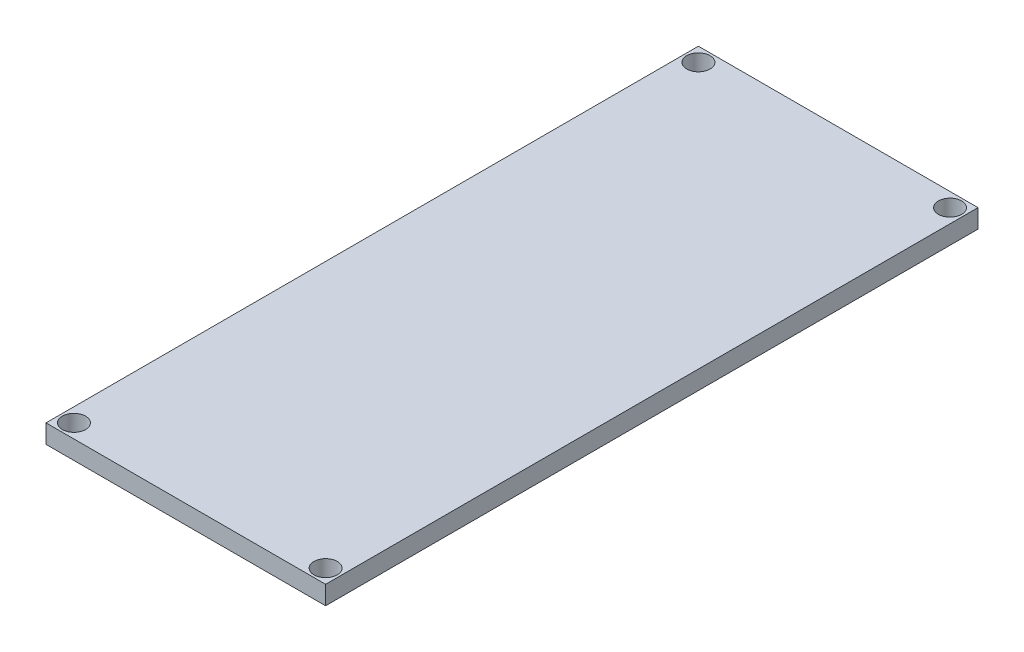
ISO-10303-21;
HEADER;
FILE_DESCRIPTION(('STEP AP214'),'2;1');
FILE_NAME('part.step','',(''),(''),'','','');
FILE_SCHEMA(('AUTOMOTIVE_DESIGN { 1 0 10303 214 1 1 1 1 }'));
ENDSEC;
DATA;
#1=APPLICATION_CONTEXT('core data for automotive mechanical design processes');
#2=APPLICATION_PROTOCOL_DEFINITION('international standard','automotive_design',2000,#1);
#3=PRODUCT_CONTEXT('',#1,'mechanical');
#4=PRODUCT('Part','Part','',(#3));
#5=PRODUCT_RELATED_PRODUCT_CATEGORY('part','',(#4));
#6=PRODUCT_DEFINITION_FORMATION('','',#4);
#7=PRODUCT_DEFINITION_CONTEXT('part definition',#1,'design');
#8=PRODUCT_DEFINITION('design','',#6,#7);
#9=PRODUCT_DEFINITION_SHAPE('','',#8);
#10=(LENGTH_UNIT() NAMED_UNIT(*) SI_UNIT(.MILLI.,.METRE.));
#11=(NAMED_UNIT(*) PLANE_ANGLE_UNIT() SI_UNIT($,.RADIAN.));
#12=(NAMED_UNIT(*) SI_UNIT($,.STERADIAN.) SOLID_ANGLE_UNIT());
#13=UNCERTAINTY_MEASURE_WITH_UNIT(LENGTH_MEASURE(1.E-05),#10,'distance_accuracy_value','');
#14=(GEOMETRIC_REPRESENTATION_CONTEXT(3) GLOBAL_UNCERTAINTY_ASSIGNED_CONTEXT((#13)) GLOBAL_UNIT_ASSIGNED_CONTEXT((#10,
#11,#12)) REPRESENTATION_CONTEXT('',''));
#15=CARTESIAN_POINT('',(0.,0.,0.));
#16=DIRECTION('',(0.,0.,1.));
#17=DIRECTION('',(1.,0.,0.));
#18=AXIS2_PLACEMENT_3D('',#15,#16,#17);
#19=CARTESIAN_POINT('',(-15.,2.,35.));
#20=DIRECTION('',(1.,0.,0.));
#21=DIRECTION('',(0.,0.,-1.));
#22=AXIS2_PLACEMENT_3D('',#19,#20,#21);
#23=PLANE('',#22);
#24=DIRECTION('',(0.,0.,1.));
#25=VECTOR('',#24,1.);
#26=CARTESIAN_POINT('',(-15.,0.,35.));
#27=LINE('',#26,#25);
#28=CARTESIAN_POINT('',(-15.,0.,-35.));
#29=VERTEX_POINT('',#28);
#30=CARTESIAN_POINT('',(-15.,0.,35.));
#31=VERTEX_POINT('',#30);
#32=EDGE_CURVE('E107',#29,#31,#27,.T.);
#33=ORIENTED_EDGE('',*,*,#32,.T.);
#34=DIRECTION('',(0.,-1.,0.));
#35=VECTOR('',#34,1.);
#36=CARTESIAN_POINT('',(-15.,2.,35.));
#37=LINE('',#36,#35);
#38=CARTESIAN_POINT('',(-15.,2.,35.));
#39=VERTEX_POINT('',#38);
#40=EDGE_CURVE('E11',#39,#31,#37,.T.);
#41=ORIENTED_EDGE('',*,*,#40,.F.);
#42=DIRECTION('',(0.,0.,1.));
#43=VECTOR('',#42,1.);
#44=CARTESIAN_POINT('',(-15.,2.,35.));
#45=LINE('',#44,#43);
#46=CARTESIAN_POINT('',(-15.,2.,-35.));
#47=VERTEX_POINT('',#46);
#48=EDGE_CURVE('E91',#47,#39,#45,.T.);
#49=ORIENTED_EDGE('',*,*,#48,.F.);
#50=DIRECTION('',(0.,-1.,0.));
#51=VECTOR('',#50,1.);
#52=CARTESIAN_POINT('',(-15.,2.,-35.));
#53=LINE('',#52,#51);
#54=EDGE_CURVE('E103',#47,#29,#53,.T.);
#55=ORIENTED_EDGE('',*,*,#54,.T.);
#56=EDGE_LOOP('',(#33,#41,#49,#55));
#57=FACE_BOUND('',#56,.T.);
#58=ADVANCED_FACE('F39',(#57),#23,.F.);
#59=CARTESIAN_POINT('',(15.,2.,35.));
#60=DIRECTION('',(0.,0.,-1.));
#61=DIRECTION('',(-1.,0.,0.));
#62=AXIS2_PLACEMENT_3D('',#59,#60,#61);
#63=PLANE('',#62);
#64=DIRECTION('',(1.,0.,0.));
#65=VECTOR('',#64,1.);
#66=CARTESIAN_POINT('',(15.,0.,35.));
#67=LINE('',#66,#65);
#68=CARTESIAN_POINT('',(15.,0.,35.));
#69=VERTEX_POINT('',#68);
#70=EDGE_CURVE('E96',#31,#69,#67,.T.);
#71=ORIENTED_EDGE('',*,*,#70,.T.);
#72=DIRECTION('',(0.,-1.,0.));
#73=VECTOR('',#72,1.);
#74=CARTESIAN_POINT('',(15.,2.,35.));
#75=LINE('',#74,#73);
#76=CARTESIAN_POINT('',(15.,2.,35.));
#77=VERTEX_POINT('',#76);
#78=EDGE_CURVE('E48',#77,#69,#75,.T.);
#79=ORIENTED_EDGE('',*,*,#78,.F.);
#80=DIRECTION('',(1.,0.,0.));
#81=VECTOR('',#80,1.);
#82=CARTESIAN_POINT('',(15.,2.,35.));
#83=LINE('',#82,#81);
#84=EDGE_CURVE('E86',#39,#77,#83,.T.);
#85=ORIENTED_EDGE('',*,*,#84,.F.);
#86=ORIENTED_EDGE('',*,*,#40,.T.);
#87=EDGE_LOOP('',(#71,#79,#85,#86));
#88=FACE_BOUND('',#87,.T.);
#89=ADVANCED_FACE('F95',(#88),#63,.F.);
#90=CARTESIAN_POINT('',(15.,2.,35.));
#91=DIRECTION('',(-1.,0.,0.));
#92=DIRECTION('',(0.,0.,1.));
#93=AXIS2_PLACEMENT_3D('',#90,#91,#92);
#94=PLANE('',#93);
#95=DIRECTION('',(0.,0.,-1.));
#96=VECTOR('',#95,1.);
#97=CARTESIAN_POINT('',(15.,0.,35.));
#98=LINE('',#97,#96);
#99=CARTESIAN_POINT('',(15.,0.,-35.));
#100=VERTEX_POINT('',#99);
#101=EDGE_CURVE('E73',#69,#100,#98,.T.);
#102=ORIENTED_EDGE('',*,*,#101,.T.);
#103=DIRECTION('',(0.,-1.,0.));
#104=VECTOR('',#103,1.);
#105=CARTESIAN_POINT('',(15.,2.,-35.));
#106=LINE('',#105,#104);
#107=CARTESIAN_POINT('',(15.,2.,-35.));
#108=VERTEX_POINT('',#107);
#109=EDGE_CURVE('E98',#108,#100,#106,.T.);
#110=ORIENTED_EDGE('',*,*,#109,.F.);
#111=DIRECTION('',(0.,0.,-1.));
#112=VECTOR('',#111,1.);
#113=CARTESIAN_POINT('',(15.,2.,35.));
#114=LINE('',#113,#112);
#115=EDGE_CURVE('E89',#77,#108,#114,.T.);
#116=ORIENTED_EDGE('',*,*,#115,.F.);
#117=ORIENTED_EDGE('',*,*,#78,.T.);
#118=EDGE_LOOP('',(#102,#110,#116,#117));
#119=FACE_BOUND('',#118,.T.);
#120=ADVANCED_FACE('F99',(#119),#94,.F.);
#121=CARTESIAN_POINT('',(15.,2.,-35.));
#122=DIRECTION('',(0.,0.,1.));
#123=DIRECTION('',(1.,0.,0.));
#124=AXIS2_PLACEMENT_3D('',#121,#122,#123);
#125=PLANE('',#124);
#126=DIRECTION('',(-1.,0.,0.));
#127=VECTOR('',#126,1.);
#128=CARTESIAN_POINT('',(15.,0.,-35.));
#129=LINE('',#128,#127);
#130=EDGE_CURVE('E79',#100,#29,#129,.T.);
#131=ORIENTED_EDGE('',*,*,#130,.T.);
#132=ORIENTED_EDGE('',*,*,#54,.F.);
#133=DIRECTION('',(-1.,0.,0.));
#134=VECTOR('',#133,1.);
#135=CARTESIAN_POINT('',(15.,2.,-35.));
#136=LINE('',#135,#134);
#137=EDGE_CURVE('E56',#108,#47,#136,.T.);
#138=ORIENTED_EDGE('',*,*,#137,.F.);
#139=ORIENTED_EDGE('',*,*,#109,.T.);
#140=EDGE_LOOP('',(#131,#132,#138,#139));
#141=FACE_BOUND('',#140,.T.);
#142=ADVANCED_FACE('F121',(#141),#125,.F.);
#143=CARTESIAN_POINT('',(0.,2.,0.));
#144=DIRECTION('',(0.,1.,0.));
#145=DIRECTION('',(0.,0.,1.));
#146=AXIS2_PLACEMENT_3D('',#143,#144,#145);
#147=PLANE('',#146);
#148=CARTESIAN_POINT('',(-13.5,2.,33.5));
#149=DIRECTION('',(0.,1.,0.));
#150=DIRECTION('',(0.,0.,-1.));
#151=AXIS2_PLACEMENT_3D('',#148,#149,#150);
#152=CIRCLE('',#151,1.25);
#153=CARTESIAN_POINT('',(-13.5,2.,32.25));
#154=VERTEX_POINT('',#153);
#155=EDGE_CURVE('E141',#154,#154,#152,.T.);
#156=ORIENTED_EDGE('',*,*,#155,.F.);
#157=EDGE_LOOP('',(#156));
#158=FACE_BOUND('',#157,.T.);
#159=CARTESIAN_POINT('',(13.4999999999998,2.,33.5000000000001));
#160=DIRECTION('',(0.,1.,0.));
#161=DIRECTION('',(0.,0.,1.));
#162=AXIS2_PLACEMENT_3D('',#159,#160,#161);
#163=CIRCLE('',#162,1.25);
#164=CARTESIAN_POINT('',(13.4999999999998,2.,34.7500000000001));
#165=VERTEX_POINT('',#164);
#166=EDGE_CURVE('E140',#165,#165,#163,.T.);
#167=ORIENTED_EDGE('',*,*,#166,.F.);
#168=EDGE_LOOP('',(#167));
#169=FACE_BOUND('',#168,.T.);
#170=CARTESIAN_POINT('',(13.4999999999998,2.,-33.5000000000001));
#171=DIRECTION('',(0.,1.,0.));
#172=DIRECTION('',(0.,0.,-1.));
#173=AXIS2_PLACEMENT_3D('',#170,#171,#172);
#174=CIRCLE('',#173,1.25);
#175=CARTESIAN_POINT('',(13.4999999999998,2.,-34.7500000000001));
#176=VERTEX_POINT('',#175);
#177=EDGE_CURVE('E149',#176,#176,#174,.T.);
#178=ORIENTED_EDGE('',*,*,#177,.F.);
#179=EDGE_LOOP('',(#178));
#180=FACE_BOUND('',#179,.T.);
#181=CARTESIAN_POINT('',(-13.5,2.,-33.5));
#182=DIRECTION('',(0.,1.,0.));
#183=DIRECTION('',(0.,0.,1.));
#184=AXIS2_PLACEMENT_3D('',#181,#182,#183);
#185=CIRCLE('',#184,1.25);
#186=CARTESIAN_POINT('',(-13.5,2.,-32.25));
#187=VERTEX_POINT('',#186);
#188=EDGE_CURVE('E131',#187,#187,#185,.T.);
#189=ORIENTED_EDGE('',*,*,#188,.F.);
#190=EDGE_LOOP('',(#189));
#191=FACE_BOUND('',#190,.T.);
#192=ORIENTED_EDGE('',*,*,#48,.T.);
#193=ORIENTED_EDGE('',*,*,#84,.T.);
#194=ORIENTED_EDGE('',*,*,#115,.T.);
#195=ORIENTED_EDGE('',*,*,#137,.T.);
#196=EDGE_LOOP('',(#192,#193,#194,#195));
#197=FACE_BOUND('',#196,.T.);
#198=ADVANCED_FACE('F87',(#158,#169,#180,#191,#197),#147,.T.);
#199=CARTESIAN_POINT('',(0.,0.,0.));
#200=DIRECTION('',(0.,1.,0.));
#201=DIRECTION('',(0.,0.,1.));
#202=AXIS2_PLACEMENT_3D('',#199,#200,#201);
#203=PLANE('',#202);
#204=CARTESIAN_POINT('',(-13.5,0.,33.5));
#205=DIRECTION('',(0.,1.,0.));
#206=DIRECTION('',(0.,0.,1.));
#207=AXIS2_PLACEMENT_3D('',#204,#205,#206);
#208=CIRCLE('',#207,1.25);
#209=CARTESIAN_POINT('',(-13.5,0.,34.75));
#210=VERTEX_POINT('',#209);
#211=EDGE_CURVE('E136',#210,#210,#208,.F.);
#212=ORIENTED_EDGE('',*,*,#211,.F.);
#213=EDGE_LOOP('',(#212));
#214=FACE_BOUND('',#213,.T.);
#215=CARTESIAN_POINT('',(13.4999999999998,0.,33.5000000000001));
#216=DIRECTION('',(0.,1.,0.));
#217=DIRECTION('',(0.,0.,1.));
#218=AXIS2_PLACEMENT_3D('',#215,#216,#217);
#219=CIRCLE('',#218,1.25);
#220=CARTESIAN_POINT('',(13.4999999999998,0.,34.7500000000001));
#221=VERTEX_POINT('',#220);
#222=EDGE_CURVE('E145',#221,#221,#219,.F.);
#223=ORIENTED_EDGE('',*,*,#222,.F.);
#224=EDGE_LOOP('',(#223));
#225=FACE_BOUND('',#224,.T.);
#226=CARTESIAN_POINT('',(13.4999999999998,0.,-33.5000000000001));
#227=DIRECTION('',(0.,1.,0.));
#228=DIRECTION('',(0.,0.,1.));
#229=AXIS2_PLACEMENT_3D('',#226,#227,#228);
#230=CIRCLE('',#229,1.25);
#231=CARTESIAN_POINT('',(13.4999999999998,0.,-32.2500000000001));
#232=VERTEX_POINT('',#231);
#233=EDGE_CURVE('E135',#232,#232,#230,.F.);
#234=ORIENTED_EDGE('',*,*,#233,.F.);
#235=EDGE_LOOP('',(#234));
#236=FACE_BOUND('',#235,.T.);
#237=CARTESIAN_POINT('',(-13.5,0.,-33.5));
#238=DIRECTION('',(0.,1.,0.));
#239=DIRECTION('',(0.,0.,1.));
#240=AXIS2_PLACEMENT_3D('',#237,#238,#239);
#241=CIRCLE('',#240,1.25);
#242=CARTESIAN_POINT('',(-13.5,0.,-32.25));
#243=VERTEX_POINT('',#242);
#244=EDGE_CURVE('E111',#243,#243,#241,.F.);
#245=ORIENTED_EDGE('',*,*,#244,.F.);
#246=EDGE_LOOP('',(#245));
#247=FACE_BOUND('',#246,.T.);
#248=ORIENTED_EDGE('',*,*,#32,.F.);
#249=ORIENTED_EDGE('',*,*,#130,.F.);
#250=ORIENTED_EDGE('',*,*,#101,.F.);
#251=ORIENTED_EDGE('',*,*,#70,.F.);
#252=EDGE_LOOP('',(#248,#249,#250,#251));
#253=FACE_BOUND('',#252,.T.);
#254=ADVANCED_FACE('F124',(#214,#225,#236,#247,#253),#203,.F.);
#255=CARTESIAN_POINT('',(-13.5,-3.53553390593274,-33.5));
#256=DIRECTION('',(0.,1.,0.));
#257=DIRECTION('',(0.,0.,1.));
#258=AXIS2_PLACEMENT_3D('',#255,#256,#257);
#259=CYLINDRICAL_SURFACE('',#258,1.25);
#260=ORIENTED_EDGE('',*,*,#244,.T.);
#261=EDGE_LOOP('',(#260));
#262=FACE_BOUND('',#261,.T.);
#263=ORIENTED_EDGE('',*,*,#188,.T.);
#264=EDGE_LOOP('',(#263));
#265=FACE_BOUND('',#264,.T.);
#266=ADVANCED_FACE('F168',(#262,#265),#259,.F.);
#267=CARTESIAN_POINT('',(13.4999999999998,-3.53553390593274,-33.5000000000001));
#268=DIRECTION('',(0.,1.,0.));
#269=DIRECTION('',(0.,0.,1.));
#270=AXIS2_PLACEMENT_3D('',#267,#268,#269);
#271=CYLINDRICAL_SURFACE('',#270,1.25);
#272=ORIENTED_EDGE('',*,*,#233,.T.);
#273=EDGE_LOOP('',(#272));
#274=FACE_BOUND('',#273,.T.);
#275=ORIENTED_EDGE('',*,*,#177,.T.);
#276=EDGE_LOOP('',(#275));
#277=FACE_BOUND('',#276,.T.);
#278=ADVANCED_FACE('F160',(#274,#277),#271,.F.);
#279=CARTESIAN_POINT('',(13.4999999999998,-3.53553390593274,33.5000000000001));
#280=DIRECTION('',(0.,1.,0.));
#281=DIRECTION('',(0.,0.,1.));
#282=AXIS2_PLACEMENT_3D('',#279,#280,#281);
#283=CYLINDRICAL_SURFACE('',#282,1.25);
#284=ORIENTED_EDGE('',*,*,#222,.T.);
#285=EDGE_LOOP('',(#284));
#286=FACE_BOUND('',#285,.T.);
#287=ORIENTED_EDGE('',*,*,#166,.T.);
#288=EDGE_LOOP('',(#287));
#289=FACE_BOUND('',#288,.T.);
#290=ADVANCED_FACE('F176',(#286,#289),#283,.F.);
#291=CARTESIAN_POINT('',(-13.5,-3.53553390593274,33.5));
#292=DIRECTION('',(0.,1.,0.));
#293=DIRECTION('',(0.,0.,1.));
#294=AXIS2_PLACEMENT_3D('',#291,#292,#293);
#295=CYLINDRICAL_SURFACE('',#294,1.25);
#296=ORIENTED_EDGE('',*,*,#211,.T.);
#297=EDGE_LOOP('',(#296));
#298=FACE_BOUND('',#297,.T.);
#299=ORIENTED_EDGE('',*,*,#155,.T.);
#300=EDGE_LOOP('',(#299));
#301=FACE_BOUND('',#300,.T.);
#302=ADVANCED_FACE('F223',(#298,#301),#295,.F.);
#303=CLOSED_SHELL('',(#58,#89,#120,#142,#198,#254,#266,#278,#290,#302));
#304=MANIFOLD_SOLID_BREP('B2',#303);
#305=ADVANCED_BREP_SHAPE_REPRESENTATION('',(#18,#304),#14);
#306=SHAPE_DEFINITION_REPRESENTATION(#9,#305);
ENDSEC;
END-ISO-10303-21;
